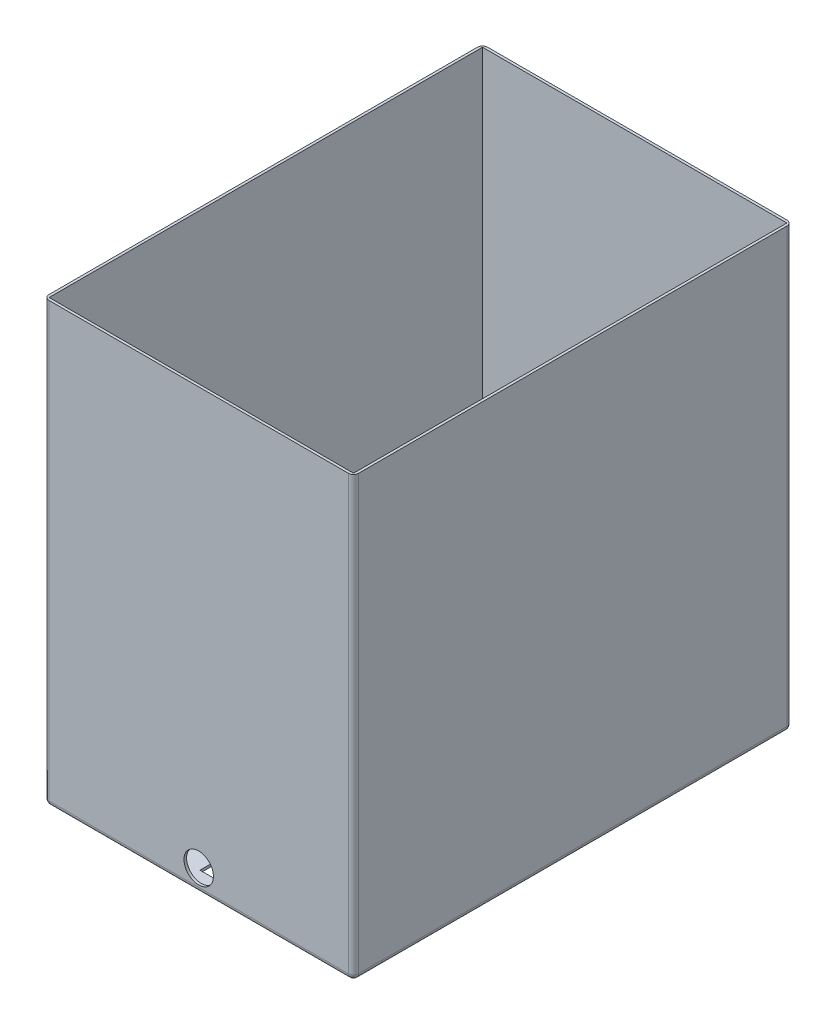
ISO-10303-21;
HEADER;
FILE_DESCRIPTION(('STEP AP214'),'2;1');
FILE_NAME('part.step','',(''),(''),'','','');
FILE_SCHEMA(('AUTOMOTIVE_DESIGN { 1 0 10303 214 1 1 1 1 }'));
ENDSEC;
DATA;
#1=APPLICATION_CONTEXT('core data for automotive mechanical design processes');
#2=APPLICATION_PROTOCOL_DEFINITION('international standard','automotive_design',2000,#1);
#3=PRODUCT_CONTEXT('',#1,'mechanical');
#4=PRODUCT('Part','Part','',(#3));
#5=PRODUCT_RELATED_PRODUCT_CATEGORY('part','',(#4));
#6=PRODUCT_DEFINITION_FORMATION('','',#4);
#7=PRODUCT_DEFINITION_CONTEXT('part definition',#1,'design');
#8=PRODUCT_DEFINITION('design','',#6,#7);
#9=PRODUCT_DEFINITION_SHAPE('','',#8);
#10=(LENGTH_UNIT() NAMED_UNIT(*) SI_UNIT(.MILLI.,.METRE.));
#11=(NAMED_UNIT(*) PLANE_ANGLE_UNIT() SI_UNIT($,.RADIAN.));
#12=(NAMED_UNIT(*) SI_UNIT($,.STERADIAN.) SOLID_ANGLE_UNIT());
#13=UNCERTAINTY_MEASURE_WITH_UNIT(LENGTH_MEASURE(1.E-05),#10,'distance_accuracy_value','');
#14=(GEOMETRIC_REPRESENTATION_CONTEXT(3) GLOBAL_UNCERTAINTY_ASSIGNED_CONTEXT((#13)) GLOBAL_UNIT_ASSIGNED_CONTEXT((#10,
#11,#12)) REPRESENTATION_CONTEXT('',''));
#15=CARTESIAN_POINT('',(0.,0.,0.));
#16=DIRECTION('',(0.,0.,1.));
#17=DIRECTION('',(1.,0.,0.));
#18=AXIS2_PLACEMENT_3D('',#15,#16,#17);
#19=CARTESIAN_POINT('',(0.,0.,431.8));
#20=DIRECTION('',(1.,0.,0.));
#21=DIRECTION('',(0.,0.,-1.));
#22=AXIS2_PLACEMENT_3D('',#19,#20,#21);
#23=PLANE('',#22);
#24=DIRECTION('',(0.,0.,-1.));
#25=VECTOR('',#24,1.);
#26=CARTESIAN_POINT('',(0.,431.8,431.8));
#27=LINE('',#26,#25);
#28=CARTESIAN_POINT('',(0.,431.8,426.72));
#29=VERTEX_POINT('',#28);
#30=CARTESIAN_POINT('',(0.,431.8,5.07999999999997));
#31=VERTEX_POINT('',#30);
#32=EDGE_CURVE('E234',#29,#31,#27,.T.);
#33=ORIENTED_EDGE('',*,*,#32,.T.);
#34=DIRECTION('',(0.,-1.,0.));
#35=VECTOR('',#34,1.);
#36=CARTESIAN_POINT('',(0.,0.,5.07999999999997));
#37=LINE('',#36,#35);
#38=CARTESIAN_POINT('',(0.,5.08,5.07999999999997));
#39=VERTEX_POINT('',#38);
#40=EDGE_CURVE('E256',#31,#39,#37,.T.);
#41=ORIENTED_EDGE('',*,*,#40,.T.);
#42=DIRECTION('',(0.,0.,-1.));
#43=VECTOR('',#42,1.);
#44=CARTESIAN_POINT('',(0.,5.08,431.8));
#45=LINE('',#44,#43);
#46=CARTESIAN_POINT('',(0.,5.08,426.72));
#47=VERTEX_POINT('',#46);
#48=EDGE_CURVE('E253',#39,#47,#45,.F.);
#49=ORIENTED_EDGE('',*,*,#48,.T.);
#50=DIRECTION('',(0.,-1.,0.));
#51=VECTOR('',#50,1.);
#52=CARTESIAN_POINT('',(0.,0.,426.72));
#53=LINE('',#52,#51);
#54=EDGE_CURVE('E251',#47,#29,#53,.F.);
#55=ORIENTED_EDGE('',*,*,#54,.T.);
#56=EDGE_LOOP('',(#33,#41,#49,#55));
#57=FACE_BOUND('',#56,.T.);
#58=ADVANCED_FACE('F36',(#57),#23,.F.);
#59=CARTESIAN_POINT('',(0.,0.,431.8));
#60=DIRECTION('',(0.,1.,0.));
#61=DIRECTION('',(0.,0.,1.));
#62=AXIS2_PLACEMENT_3D('',#59,#60,#61);
#63=PLANE('',#62);
#64=DIRECTION('',(-1.,0.,0.));
#65=VECTOR('',#64,1.);
#66=CARTESIAN_POINT('',(135.89,0.,327.914));
#67=LINE('',#66,#65);
#68=CARTESIAN_POINT('',(168.91,0.,327.914));
#69=VERTEX_POINT('',#68);
#70=CARTESIAN_POINT('',(135.89,0.,327.914));
#71=VERTEX_POINT('',#70);
#72=EDGE_CURVE('E170',#69,#71,#67,.T.);
#73=ORIENTED_EDGE('',*,*,#72,.T.);
#74=DIRECTION('',(0.,0.,1.));
#75=VECTOR('',#74,1.);
#76=CARTESIAN_POINT('',(135.89,0.,414.02));
#77=LINE('',#76,#75);
#78=CARTESIAN_POINT('',(135.89,0.,414.02));
#79=VERTEX_POINT('',#78);
#80=EDGE_CURVE('E164',#71,#79,#77,.T.);
#81=ORIENTED_EDGE('',*,*,#80,.T.);
#82=DIRECTION('',(1.,0.,0.));
#83=VECTOR('',#82,1.);
#84=CARTESIAN_POINT('',(135.89,0.,414.02));
#85=LINE('',#84,#83);
#86=CARTESIAN_POINT('',(168.91,0.,414.02));
#87=VERTEX_POINT('',#86);
#88=EDGE_CURVE('E173',#79,#87,#85,.T.);
#89=ORIENTED_EDGE('',*,*,#88,.T.);
#90=DIRECTION('',(0.,0.,-1.));
#91=VECTOR('',#90,1.);
#92=CARTESIAN_POINT('',(168.91,0.,414.02));
#93=LINE('',#92,#91);
#94=EDGE_CURVE('E53',#87,#69,#93,.T.);
#95=ORIENTED_EDGE('',*,*,#94,.T.);
#96=EDGE_LOOP('',(#73,#81,#89,#95));
#97=FACE_BOUND('',#96,.T.);
#98=DIRECTION('',(1.,0.,0.));
#99=VECTOR('',#98,1.);
#100=CARTESIAN_POINT('',(0.,0.,426.72));
#101=LINE('',#100,#99);
#102=CARTESIAN_POINT('',(299.72,0.,426.72));
#103=VERTEX_POINT('',#102);
#104=CARTESIAN_POINT('',(5.08,0.,426.72));
#105=VERTEX_POINT('',#104);
#106=EDGE_CURVE('E246',#103,#105,#101,.F.);
#107=ORIENTED_EDGE('',*,*,#106,.T.);
#108=DIRECTION('',(0.,0.,-1.));
#109=VECTOR('',#108,1.);
#110=CARTESIAN_POINT('',(5.08,0.,431.8));
#111=LINE('',#110,#109);
#112=CARTESIAN_POINT('',(5.08,0.,5.07999999999997));
#113=VERTEX_POINT('',#112);
#114=EDGE_CURVE('E248',#105,#113,#111,.T.);
#115=ORIENTED_EDGE('',*,*,#114,.T.);
#116=DIRECTION('',(1.,0.,0.));
#117=VECTOR('',#116,1.);
#118=CARTESIAN_POINT('',(304.8,0.,5.07999999999997));
#119=LINE('',#118,#117);
#120=CARTESIAN_POINT('',(299.72,0.,5.07999999999997));
#121=VERTEX_POINT('',#120);
#122=EDGE_CURVE('E242',#113,#121,#119,.T.);
#123=ORIENTED_EDGE('',*,*,#122,.T.);
#124=DIRECTION('',(0.,0.,-1.));
#125=VECTOR('',#124,1.);
#126=CARTESIAN_POINT('',(299.72,0.,431.8));
#127=LINE('',#126,#125);
#128=EDGE_CURVE('E244',#121,#103,#127,.F.);
#129=ORIENTED_EDGE('',*,*,#128,.T.);
#130=EDGE_LOOP('',(#107,#115,#123,#129));
#131=FACE_BOUND('',#130,.T.);
#132=ADVANCED_FACE('F177',(#97,#131),#63,.F.);
#133=CARTESIAN_POINT('',(304.8,0.,431.8));
#134=DIRECTION('',(-1.,0.,0.));
#135=DIRECTION('',(0.,0.,1.));
#136=AXIS2_PLACEMENT_3D('',#133,#134,#135);
#137=PLANE('',#136);
#138=DIRECTION('',(0.,0.,-1.));
#139=VECTOR('',#138,1.);
#140=CARTESIAN_POINT('',(304.8,5.08,431.8));
#141=LINE('',#140,#139);
#142=CARTESIAN_POINT('',(304.8,5.08,426.72));
#143=VERTEX_POINT('',#142);
#144=CARTESIAN_POINT('',(304.8,5.08,5.07999999999997));
#145=VERTEX_POINT('',#144);
#146=EDGE_CURVE('E266',#143,#145,#141,.T.);
#147=ORIENTED_EDGE('',*,*,#146,.T.);
#148=DIRECTION('',(0.,1.,0.));
#149=VECTOR('',#148,1.);
#150=CARTESIAN_POINT('',(304.8,431.8,5.07999999999997));
#151=LINE('',#150,#149);
#152=CARTESIAN_POINT('',(304.8,431.8,5.07999999999997));
#153=VERTEX_POINT('',#152);
#154=EDGE_CURVE('E268',#145,#153,#151,.T.);
#155=ORIENTED_EDGE('',*,*,#154,.T.);
#156=DIRECTION('',(0.,0.,-1.));
#157=VECTOR('',#156,1.);
#158=CARTESIAN_POINT('',(304.8,431.8,431.8));
#159=LINE('',#158,#157);
#160=CARTESIAN_POINT('',(304.8,431.8,426.72));
#161=VERTEX_POINT('',#160);
#162=EDGE_CURVE('E239',#161,#153,#159,.T.);
#163=ORIENTED_EDGE('',*,*,#162,.F.);
#164=DIRECTION('',(0.,1.,0.));
#165=VECTOR('',#164,1.);
#166=CARTESIAN_POINT('',(304.8,0.,426.72));
#167=LINE('',#166,#165);
#168=EDGE_CURVE('E264',#161,#143,#167,.F.);
#169=ORIENTED_EDGE('',*,*,#168,.T.);
#170=EDGE_LOOP('',(#147,#155,#163,#169));
#171=FACE_BOUND('',#170,.T.);
#172=ADVANCED_FACE('F335',(#171),#137,.F.);
#173=CARTESIAN_POINT('',(0.,431.8,431.8));
#174=DIRECTION('',(0.,-1.,0.));
#175=DIRECTION('',(0.,0.,-1.));
#176=AXIS2_PLACEMENT_3D('',#173,#174,#175);
#177=PLANE('',#176);
#178=DIRECTION('',(-1.,0.,0.));
#179=VECTOR('',#178,1.);
#180=CARTESIAN_POINT('',(302.26,431.8,2.54));
#181=LINE('',#180,#179);
#182=CARTESIAN_POINT('',(302.26,431.8,2.53999999999999));
#183=VERTEX_POINT('',#182);
#184=CARTESIAN_POINT('',(2.54,431.8,2.54));
#185=VERTEX_POINT('',#184);
#186=EDGE_CURVE('E211',#183,#185,#181,.T.);
#187=ORIENTED_EDGE('',*,*,#186,.F.);
#188=DIRECTION('',(0.,0.,-1.));
#189=VECTOR('',#188,1.);
#190=CARTESIAN_POINT('',(302.26,431.8,429.26));
#191=LINE('',#190,#189);
#192=CARTESIAN_POINT('',(302.26,431.8,429.26));
#193=VERTEX_POINT('',#192);
#194=EDGE_CURVE('E209',#193,#183,#191,.T.);
#195=ORIENTED_EDGE('',*,*,#194,.F.);
#196=DIRECTION('',(1.,0.,0.));
#197=VECTOR('',#196,1.);
#198=CARTESIAN_POINT('',(2.54,431.8,429.26));
#199=LINE('',#198,#197);
#200=CARTESIAN_POINT('',(2.54,431.8,429.26));
#201=VERTEX_POINT('',#200);
#202=EDGE_CURVE('E218',#201,#193,#199,.T.);
#203=ORIENTED_EDGE('',*,*,#202,.F.);
#204=DIRECTION('',(0.,0.,1.));
#205=VECTOR('',#204,1.);
#206=CARTESIAN_POINT('',(2.54,431.8,2.54));
#207=LINE('',#206,#205);
#208=EDGE_CURVE('E215',#185,#201,#207,.T.);
#209=ORIENTED_EDGE('',*,*,#208,.F.);
#210=EDGE_LOOP('',(#187,#195,#203,#209));
#211=FACE_BOUND('',#210,.T.);
#212=DIRECTION('',(-1.,0.,0.));
#213=VECTOR('',#212,1.);
#214=CARTESIAN_POINT('',(0.,431.8,0.));
#215=LINE('',#214,#213);
#216=CARTESIAN_POINT('',(299.72,431.8,0.));
#217=VERTEX_POINT('',#216);
#218=CARTESIAN_POINT('',(5.08,431.8,0.));
#219=VERTEX_POINT('',#218);
#220=EDGE_CURVE('E230',#217,#219,#215,.T.);
#221=ORIENTED_EDGE('',*,*,#220,.T.);
#222=CARTESIAN_POINT('',(5.08,431.8,5.07999999999997));
#223=DIRECTION('',(0.,-1.,0.));
#224=DIRECTION('',(0.,0.,-1.));
#225=AXIS2_PLACEMENT_3D('',#222,#223,#224);
#226=CIRCLE('',#225,5.08);
#227=EDGE_CURVE('E12',#219,#31,#226,.F.);
#228=ORIENTED_EDGE('',*,*,#227,.T.);
#229=ORIENTED_EDGE('',*,*,#32,.F.);
#230=CARTESIAN_POINT('',(5.08,431.8,426.72));
#231=DIRECTION('',(0.,-1.,0.));
#232=DIRECTION('',(0.,0.,-1.));
#233=AXIS2_PLACEMENT_3D('',#230,#231,#232);
#234=CIRCLE('',#233,5.08);
#235=CARTESIAN_POINT('',(5.08,431.8,431.8));
#236=VERTEX_POINT('',#235);
#237=EDGE_CURVE('E276',#29,#236,#234,.F.);
#238=ORIENTED_EDGE('',*,*,#237,.T.);
#239=DIRECTION('',(-1.,0.,0.));
#240=VECTOR('',#239,1.);
#241=CARTESIAN_POINT('',(0.,431.8,431.8));
#242=LINE('',#241,#240);
#243=CARTESIAN_POINT('',(299.72,431.8,431.8));
#244=VERTEX_POINT('',#243);
#245=EDGE_CURVE('E231',#244,#236,#242,.T.);
#246=ORIENTED_EDGE('',*,*,#245,.F.);
#247=CARTESIAN_POINT('',(299.72,431.8,426.72));
#248=DIRECTION('',(0.,-1.,0.));
#249=DIRECTION('',(0.,0.,-1.));
#250=AXIS2_PLACEMENT_3D('',#247,#248,#249);
#251=CIRCLE('',#250,5.08);
#252=EDGE_CURVE('E278',#244,#161,#251,.F.);
#253=ORIENTED_EDGE('',*,*,#252,.T.);
#254=ORIENTED_EDGE('',*,*,#162,.T.);
#255=CARTESIAN_POINT('',(299.72,431.8,5.07999999999997));
#256=DIRECTION('',(0.,-1.,0.));
#257=DIRECTION('',(0.,0.,-1.));
#258=AXIS2_PLACEMENT_3D('',#255,#256,#257);
#259=CIRCLE('',#258,5.08);
#260=EDGE_CURVE('E45',#153,#217,#259,.F.);
#261=ORIENTED_EDGE('',*,*,#260,.T.);
#262=EDGE_LOOP('',(#221,#228,#229,#238,#246,#253,#254,#261));
#263=FACE_BOUND('',#262,.T.);
#264=ADVANCED_FACE('F345',(#211,#263),#177,.F.);
#265=CARTESIAN_POINT('',(0.,0.,431.8));
#266=DIRECTION('',(0.,0.,-1.));
#267=DIRECTION('',(-1.,0.,0.));
#268=AXIS2_PLACEMENT_3D('',#265,#266,#267);
#269=PLANE('',#268);
#270=CARTESIAN_POINT('',(152.4,21.59,431.8));
#271=DIRECTION('',(0.,0.,1.));
#272=DIRECTION('',(1.,0.,0.));
#273=AXIS2_PLACEMENT_3D('',#270,#271,#272);
#274=CIRCLE('',#273,14.478);
#275=CARTESIAN_POINT('',(166.878,21.59,431.8));
#276=VERTEX_POINT('',#275);
#277=EDGE_CURVE('E186',#276,#276,#274,.T.);
#278=ORIENTED_EDGE('',*,*,#277,.F.);
#279=EDGE_LOOP('',(#278));
#280=FACE_BOUND('',#279,.T.);
#281=DIRECTION('',(1.,0.,0.));
#282=VECTOR('',#281,1.);
#283=CARTESIAN_POINT('',(0.,5.08,431.8));
#284=LINE('',#283,#282);
#285=CARTESIAN_POINT('',(5.08,5.08,431.8));
#286=VERTEX_POINT('',#285);
#287=CARTESIAN_POINT('',(299.72,5.08,431.8));
#288=VERTEX_POINT('',#287);
#289=EDGE_CURVE('E260',#286,#288,#284,.T.);
#290=ORIENTED_EDGE('',*,*,#289,.T.);
#291=DIRECTION('',(0.,1.,0.));
#292=VECTOR('',#291,1.);
#293=CARTESIAN_POINT('',(299.72,0.,431.8));
#294=LINE('',#293,#292);
#295=EDGE_CURVE('E262',#288,#244,#294,.T.);
#296=ORIENTED_EDGE('',*,*,#295,.T.);
#297=ORIENTED_EDGE('',*,*,#245,.T.);
#298=DIRECTION('',(0.,-1.,0.));
#299=VECTOR('',#298,1.);
#300=CARTESIAN_POINT('',(5.08,0.,431.8));
#301=LINE('',#300,#299);
#302=EDGE_CURVE('E258',#236,#286,#301,.T.);
#303=ORIENTED_EDGE('',*,*,#302,.T.);
#304=EDGE_LOOP('',(#290,#296,#297,#303));
#305=FACE_BOUND('',#304,.T.);
#306=ADVANCED_FACE('F373',(#280,#305),#269,.F.);
#307=CARTESIAN_POINT('',(0.,0.,0.));
#308=DIRECTION('',(0.,0.,-1.));
#309=DIRECTION('',(-1.,0.,0.));
#310=AXIS2_PLACEMENT_3D('',#307,#308,#309);
#311=PLANE('',#310);
#312=DIRECTION('',(1.,0.,0.));
#313=VECTOR('',#312,1.);
#314=CARTESIAN_POINT('',(0.,5.08,0.));
#315=LINE('',#314,#313);
#316=CARTESIAN_POINT('',(299.72,5.08,0.));
#317=VERTEX_POINT('',#316);
#318=CARTESIAN_POINT('',(5.08,5.08,0.));
#319=VERTEX_POINT('',#318);
#320=EDGE_CURVE('E272',#317,#319,#315,.F.);
#321=ORIENTED_EDGE('',*,*,#320,.T.);
#322=DIRECTION('',(0.,-1.,0.));
#323=VECTOR('',#322,1.);
#324=CARTESIAN_POINT('',(5.08,431.8,0.));
#325=LINE('',#324,#323);
#326=EDGE_CURVE('E274',#319,#219,#325,.F.);
#327=ORIENTED_EDGE('',*,*,#326,.T.);
#328=ORIENTED_EDGE('',*,*,#220,.F.);
#329=DIRECTION('',(0.,1.,0.));
#330=VECTOR('',#329,1.);
#331=CARTESIAN_POINT('',(299.72,0.,0.));
#332=LINE('',#331,#330);
#333=EDGE_CURVE('E270',#217,#317,#332,.F.);
#334=ORIENTED_EDGE('',*,*,#333,.T.);
#335=EDGE_LOOP('',(#321,#327,#328,#334));
#336=FACE_BOUND('',#335,.T.);
#337=ADVANCED_FACE('F348',(#336),#311,.T.);
#338=CARTESIAN_POINT('',(302.26,-521.461443253478,429.26));
#339=DIRECTION('',(1.,0.,0.));
#340=DIRECTION('',(0.,0.,-1.));
#341=AXIS2_PLACEMENT_3D('',#338,#339,#340);
#342=PLANE('',#341);
#343=DIRECTION('',(0.,0.,1.));
#344=VECTOR('',#343,1.);
#345=CARTESIAN_POINT('',(302.26,2.53999999999999,429.26));
#346=LINE('',#345,#344);
#347=CARTESIAN_POINT('',(302.26,2.53999999999999,2.54));
#348=VERTEX_POINT('',#347);
#349=CARTESIAN_POINT('',(302.26,2.53999999999999,429.26));
#350=VERTEX_POINT('',#349);
#351=EDGE_CURVE('E206',#348,#350,#346,.T.);
#352=ORIENTED_EDGE('',*,*,#351,.T.);
#353=DIRECTION('',(0.,1.,0.));
#354=VECTOR('',#353,1.);
#355=CARTESIAN_POINT('',(302.26,-521.461443253478,429.26));
#356=LINE('',#355,#354);
#357=EDGE_CURVE('E204',#350,#193,#356,.T.);
#358=ORIENTED_EDGE('',*,*,#357,.T.);
#359=ORIENTED_EDGE('',*,*,#194,.T.);
#360=DIRECTION('',(0.,1.,0.));
#361=VECTOR('',#360,1.);
#362=CARTESIAN_POINT('',(302.26,-521.461443253478,2.54));
#363=LINE('',#362,#361);
#364=EDGE_CURVE('E221',#348,#183,#363,.T.);
#365=ORIENTED_EDGE('',*,*,#364,.F.);
#366=EDGE_LOOP('',(#352,#358,#359,#365));
#367=FACE_BOUND('',#366,.T.);
#368=ADVANCED_FACE('F504',(#367),#342,.F.);
#369=CARTESIAN_POINT('',(2.54,-521.461443253478,429.26));
#370=DIRECTION('',(0.,0.,1.));
#371=DIRECTION('',(1.,0.,0.));
#372=AXIS2_PLACEMENT_3D('',#369,#370,#371);
#373=PLANE('',#372);
#374=CARTESIAN_POINT('',(152.4,21.59,429.26));
#375=DIRECTION('',(0.,0.,1.));
#376=DIRECTION('',(1.,0.,0.));
#377=AXIS2_PLACEMENT_3D('',#374,#375,#376);
#378=CIRCLE('',#377,14.478);
#379=CARTESIAN_POINT('',(166.878,21.59,429.26));
#380=VERTEX_POINT('',#379);
#381=EDGE_CURVE('E40',#380,#380,#378,.T.);
#382=ORIENTED_EDGE('',*,*,#381,.T.);
#383=EDGE_LOOP('',(#382));
#384=FACE_BOUND('',#383,.T.);
#385=DIRECTION('',(-1.,0.,0.));
#386=VECTOR('',#385,1.);
#387=CARTESIAN_POINT('',(2.54,2.53999999999999,429.26));
#388=LINE('',#387,#386);
#389=CARTESIAN_POINT('',(2.54,2.53999999999999,429.26));
#390=VERTEX_POINT('',#389);
#391=EDGE_CURVE('E203',#350,#390,#388,.T.);
#392=ORIENTED_EDGE('',*,*,#391,.T.);
#393=DIRECTION('',(0.,1.,0.));
#394=VECTOR('',#393,1.);
#395=CARTESIAN_POINT('',(2.54,-521.461443253478,429.26));
#396=LINE('',#395,#394);
#397=EDGE_CURVE('E223',#390,#201,#396,.T.);
#398=ORIENTED_EDGE('',*,*,#397,.T.);
#399=ORIENTED_EDGE('',*,*,#202,.T.);
#400=ORIENTED_EDGE('',*,*,#357,.F.);
#401=EDGE_LOOP('',(#392,#398,#399,#400));
#402=FACE_BOUND('',#401,.T.);
#403=ADVANCED_FACE('F498',(#384,#402),#373,.F.);
#404=CARTESIAN_POINT('',(2.54,-521.461443253478,2.54));
#405=DIRECTION('',(-1.,0.,0.));
#406=DIRECTION('',(0.,0.,1.));
#407=AXIS2_PLACEMENT_3D('',#404,#405,#406);
#408=PLANE('',#407);
#409=DIRECTION('',(0.,0.,-1.));
#410=VECTOR('',#409,1.);
#411=CARTESIAN_POINT('',(2.54,2.53999999999999,2.54));
#412=LINE('',#411,#410);
#413=CARTESIAN_POINT('',(2.54,2.53999999999999,2.54));
#414=VERTEX_POINT('',#413);
#415=EDGE_CURVE('E201',#390,#414,#412,.T.);
#416=ORIENTED_EDGE('',*,*,#415,.T.);
#417=DIRECTION('',(0.,1.,0.));
#418=VECTOR('',#417,1.);
#419=CARTESIAN_POINT('',(2.54,-521.461443253478,2.54));
#420=LINE('',#419,#418);
#421=EDGE_CURVE('E225',#414,#185,#420,.T.);
#422=ORIENTED_EDGE('',*,*,#421,.T.);
#423=ORIENTED_EDGE('',*,*,#208,.T.);
#424=ORIENTED_EDGE('',*,*,#397,.F.);
#425=EDGE_LOOP('',(#416,#422,#423,#424));
#426=FACE_BOUND('',#425,.T.);
#427=ADVANCED_FACE('F503',(#426),#408,.F.);
#428=CARTESIAN_POINT('',(302.26,-521.461443253478,2.54));
#429=DIRECTION('',(0.,0.,-1.));
#430=DIRECTION('',(-1.,0.,0.));
#431=AXIS2_PLACEMENT_3D('',#428,#429,#430);
#432=PLANE('',#431);
#433=DIRECTION('',(1.,0.,0.));
#434=VECTOR('',#433,1.);
#435=CARTESIAN_POINT('',(302.26,2.53999999999999,2.54));
#436=LINE('',#435,#434);
#437=EDGE_CURVE('E208',#414,#348,#436,.T.);
#438=ORIENTED_EDGE('',*,*,#437,.T.);
#439=ORIENTED_EDGE('',*,*,#364,.T.);
#440=ORIENTED_EDGE('',*,*,#186,.T.);
#441=ORIENTED_EDGE('',*,*,#421,.F.);
#442=EDGE_LOOP('',(#438,#439,#440,#441));
#443=FACE_BOUND('',#442,.T.);
#444=ADVANCED_FACE('F381',(#443),#432,.F.);
#445=CARTESIAN_POINT('',(0.,2.54,431.8));
#446=DIRECTION('',(0.,1.,0.));
#447=DIRECTION('',(0.,0.,1.));
#448=AXIS2_PLACEMENT_3D('',#445,#446,#447);
#449=PLANE('',#448);
#450=DIRECTION('',(0.,0.,1.));
#451=VECTOR('',#450,1.);
#452=CARTESIAN_POINT('',(135.89,2.54,414.02));
#453=LINE('',#452,#451);
#454=CARTESIAN_POINT('',(135.89,2.54,327.914));
#455=VERTEX_POINT('',#454);
#456=CARTESIAN_POINT('',(135.89,2.54,414.02));
#457=VERTEX_POINT('',#456);
#458=EDGE_CURVE('E61',#455,#457,#453,.T.);
#459=ORIENTED_EDGE('',*,*,#458,.F.);
#460=DIRECTION('',(-1.,0.,0.));
#461=VECTOR('',#460,1.);
#462=CARTESIAN_POINT('',(135.89,2.54,327.914));
#463=LINE('',#462,#461);
#464=CARTESIAN_POINT('',(168.91,2.54,327.914));
#465=VERTEX_POINT('',#464);
#466=EDGE_CURVE('E180',#465,#455,#463,.T.);
#467=ORIENTED_EDGE('',*,*,#466,.F.);
#468=DIRECTION('',(0.,0.,-1.));
#469=VECTOR('',#468,1.);
#470=CARTESIAN_POINT('',(168.91,2.54,414.02));
#471=LINE('',#470,#469);
#472=CARTESIAN_POINT('',(168.91,2.54,414.02));
#473=VERTEX_POINT('',#472);
#474=EDGE_CURVE('E183',#473,#465,#471,.T.);
#475=ORIENTED_EDGE('',*,*,#474,.F.);
#476=DIRECTION('',(1.,0.,0.));
#477=VECTOR('',#476,1.);
#478=CARTESIAN_POINT('',(135.89,2.54,414.02));
#479=LINE('',#478,#477);
#480=EDGE_CURVE('E191',#457,#473,#479,.T.);
#481=ORIENTED_EDGE('',*,*,#480,.F.);
#482=EDGE_LOOP('',(#459,#467,#475,#481));
#483=FACE_BOUND('',#482,.T.);
#484=ORIENTED_EDGE('',*,*,#351,.F.);
#485=ORIENTED_EDGE('',*,*,#437,.F.);
#486=ORIENTED_EDGE('',*,*,#415,.F.);
#487=ORIENTED_EDGE('',*,*,#391,.F.);
#488=EDGE_LOOP('',(#484,#485,#486,#487));
#489=FACE_BOUND('',#488,.T.);
#490=ADVANCED_FACE('F376',(#483,#489),#449,.T.);
#491=CARTESIAN_POINT('',(299.72,0.,426.72));
#492=DIRECTION('',(0.,1.,0.));
#493=DIRECTION('',(0.,0.,1.));
#494=AXIS2_PLACEMENT_3D('',#491,#492,#493);
#495=CYLINDRICAL_SURFACE('',#494,5.08);
#496=ORIENTED_EDGE('',*,*,#252,.F.);
#497=ORIENTED_EDGE('',*,*,#295,.F.);
#498=CARTESIAN_POINT('',(299.72,5.08,426.72));
#499=DIRECTION('',(0.,-1.,0.));
#500=DIRECTION('',(0.,0.,-1.));
#501=AXIS2_PLACEMENT_3D('',#498,#499,#500);
#502=CIRCLE('',#501,5.08);
#503=EDGE_CURVE('E212',#143,#288,#502,.T.);
#504=ORIENTED_EDGE('',*,*,#503,.F.);
#505=ORIENTED_EDGE('',*,*,#168,.F.);
#506=EDGE_LOOP('',(#496,#497,#504,#505));
#507=FACE_BOUND('',#506,.T.);
#508=ADVANCED_FACE('F38',(#507),#495,.T.);
#509=CARTESIAN_POINT('',(299.72,5.08,431.8));
#510=DIRECTION('',(0.,0.,-1.));
#511=DIRECTION('',(-1.,0.,0.));
#512=AXIS2_PLACEMENT_3D('',#509,#510,#511);
#513=CYLINDRICAL_SURFACE('',#512,5.08);
#514=CARTESIAN_POINT('',(299.72,5.08,5.07999999999997));
#515=DIRECTION('',(0.,0.,-1.));
#516=DIRECTION('',(-1.,0.,0.));
#517=AXIS2_PLACEMENT_3D('',#514,#515,#516);
#518=CIRCLE('',#517,5.08);
#519=EDGE_CURVE('E305',#145,#121,#518,.T.);
#520=ORIENTED_EDGE('',*,*,#519,.F.);
#521=ORIENTED_EDGE('',*,*,#146,.F.);
#522=CARTESIAN_POINT('',(299.72,5.08,426.72));
#523=DIRECTION('',(0.,0.,1.));
#524=DIRECTION('',(1.,0.,0.));
#525=AXIS2_PLACEMENT_3D('',#522,#523,#524);
#526=CIRCLE('',#525,5.08);
#527=EDGE_CURVE('E308',#103,#143,#526,.T.);
#528=ORIENTED_EDGE('',*,*,#527,.F.);
#529=ORIENTED_EDGE('',*,*,#128,.F.);
#530=EDGE_LOOP('',(#520,#521,#528,#529));
#531=FACE_BOUND('',#530,.T.);
#532=ADVANCED_FACE('F332',(#531),#513,.T.);
#533=CARTESIAN_POINT('',(299.72,0.,5.07999999999997));
#534=DIRECTION('',(0.,-1.,0.));
#535=DIRECTION('',(0.,0.,-1.));
#536=AXIS2_PLACEMENT_3D('',#533,#534,#535);
#537=CYLINDRICAL_SURFACE('',#536,5.08);
#538=ORIENTED_EDGE('',*,*,#260,.F.);
#539=ORIENTED_EDGE('',*,*,#154,.F.);
#540=CARTESIAN_POINT('',(299.72,5.08,5.08));
#541=DIRECTION('',(0.,-1.,0.));
#542=DIRECTION('',(0.,0.,-1.));
#543=AXIS2_PLACEMENT_3D('',#540,#541,#542);
#544=CIRCLE('',#543,5.08);
#545=EDGE_CURVE('E302',#317,#145,#544,.T.);
#546=ORIENTED_EDGE('',*,*,#545,.F.);
#547=ORIENTED_EDGE('',*,*,#333,.F.);
#548=EDGE_LOOP('',(#538,#539,#546,#547));
#549=FACE_BOUND('',#548,.T.);
#550=ADVANCED_FACE('F340',(#549),#537,.T.);
#551=CARTESIAN_POINT('',(299.72,5.08,426.72));
#552=DIRECTION('',(1.,0.,0.));
#553=DIRECTION('',(0.,0.,-1.));
#554=AXIS2_PLACEMENT_3D('',#551,#552,#553);
#555=SPHERICAL_SURFACE('',#554,5.08);
#556=ORIENTED_EDGE('',*,*,#527,.T.);
#557=ORIENTED_EDGE('',*,*,#503,.T.);
#558=CARTESIAN_POINT('',(299.72,5.08,426.72));
#559=DIRECTION('',(1.,0.,0.));
#560=DIRECTION('',(0.,0.,-1.));
#561=AXIS2_PLACEMENT_3D('',#558,#559,#560);
#562=CIRCLE('',#561,5.08);
#563=EDGE_CURVE('E299',#103,#288,#562,.F.);
#564=ORIENTED_EDGE('',*,*,#563,.F.);
#565=EDGE_LOOP('',(#556,#557,#564));
#566=FACE_BOUND('',#565,.T.);
#567=ADVANCED_FACE('F314',(#566),#555,.T.);
#568=CARTESIAN_POINT('',(299.72,5.08,5.08));
#569=DIRECTION('',(1.,0.,0.));
#570=DIRECTION('',(0.,0.,-1.));
#571=AXIS2_PLACEMENT_3D('',#568,#569,#570);
#572=SPHERICAL_SURFACE('',#571,5.08);
#573=ORIENTED_EDGE('',*,*,#545,.T.);
#574=ORIENTED_EDGE('',*,*,#519,.T.);
#575=CARTESIAN_POINT('',(299.72,5.08,5.07999999999997));
#576=DIRECTION('',(1.,0.,0.));
#577=DIRECTION('',(0.,0.,-1.));
#578=AXIS2_PLACEMENT_3D('',#575,#576,#577);
#579=CIRCLE('',#578,5.08);
#580=EDGE_CURVE('E296',#317,#121,#579,.F.);
#581=ORIENTED_EDGE('',*,*,#580,.F.);
#582=EDGE_LOOP('',(#573,#574,#581));
#583=FACE_BOUND('',#582,.T.);
#584=ADVANCED_FACE('F408',(#583),#572,.T.);
#585=CARTESIAN_POINT('',(5.08,0.,426.72));
#586=DIRECTION('',(0.,-1.,0.));
#587=DIRECTION('',(0.,0.,-1.));
#588=AXIS2_PLACEMENT_3D('',#585,#586,#587);
#589=CYLINDRICAL_SURFACE('',#588,5.08);
#590=ORIENTED_EDGE('',*,*,#237,.F.);
#591=ORIENTED_EDGE('',*,*,#54,.F.);
#592=CARTESIAN_POINT('',(5.08,5.08,426.72));
#593=DIRECTION('',(0.,-1.,0.));
#594=DIRECTION('',(0.,0.,-1.));
#595=AXIS2_PLACEMENT_3D('',#592,#593,#594);
#596=CIRCLE('',#595,5.08);
#597=EDGE_CURVE('E293',#286,#47,#596,.T.);
#598=ORIENTED_EDGE('',*,*,#597,.F.);
#599=ORIENTED_EDGE('',*,*,#302,.F.);
#600=EDGE_LOOP('',(#590,#591,#598,#599));
#601=FACE_BOUND('',#600,.T.);
#602=ADVANCED_FACE('F371',(#601),#589,.T.);
#603=CARTESIAN_POINT('',(0.,5.08,426.72));
#604=DIRECTION('',(1.,0.,0.));
#605=DIRECTION('',(0.,0.,-1.));
#606=AXIS2_PLACEMENT_3D('',#603,#604,#605);
#607=CYLINDRICAL_SURFACE('',#606,5.08);
#608=ORIENTED_EDGE('',*,*,#563,.T.);
#609=ORIENTED_EDGE('',*,*,#289,.F.);
#610=CARTESIAN_POINT('',(5.08,5.08,426.72));
#611=DIRECTION('',(-1.,0.,0.));
#612=DIRECTION('',(0.,0.,1.));
#613=AXIS2_PLACEMENT_3D('',#610,#611,#612);
#614=CIRCLE('',#613,5.08);
#615=EDGE_CURVE('E290',#105,#286,#614,.T.);
#616=ORIENTED_EDGE('',*,*,#615,.F.);
#617=ORIENTED_EDGE('',*,*,#106,.F.);
#618=EDGE_LOOP('',(#608,#609,#616,#617));
#619=FACE_BOUND('',#618,.T.);
#620=ADVANCED_FACE('F322',(#619),#607,.T.);
#621=CARTESIAN_POINT('',(0.,5.08,5.07999999999997));
#622=DIRECTION('',(-1.,0.,0.));
#623=DIRECTION('',(0.,0.,1.));
#624=AXIS2_PLACEMENT_3D('',#621,#622,#623);
#625=CYLINDRICAL_SURFACE('',#624,5.08);
#626=ORIENTED_EDGE('',*,*,#580,.T.);
#627=ORIENTED_EDGE('',*,*,#122,.F.);
#628=CARTESIAN_POINT('',(5.08,5.08,5.08));
#629=DIRECTION('',(-1.,0.,0.));
#630=DIRECTION('',(0.,0.,1.));
#631=AXIS2_PLACEMENT_3D('',#628,#629,#630);
#632=CIRCLE('',#631,5.08);
#633=EDGE_CURVE('E287',#319,#113,#632,.T.);
#634=ORIENTED_EDGE('',*,*,#633,.F.);
#635=ORIENTED_EDGE('',*,*,#320,.F.);
#636=EDGE_LOOP('',(#626,#627,#634,#635));
#637=FACE_BOUND('',#636,.T.);
#638=ADVANCED_FACE('F358',(#637),#625,.T.);
#639=CARTESIAN_POINT('',(5.08,0.,5.07999999999997));
#640=DIRECTION('',(0.,1.,0.));
#641=DIRECTION('',(0.,0.,1.));
#642=AXIS2_PLACEMENT_3D('',#639,#640,#641);
#643=CYLINDRICAL_SURFACE('',#642,5.08);
#644=ORIENTED_EDGE('',*,*,#227,.F.);
#645=ORIENTED_EDGE('',*,*,#326,.F.);
#646=CARTESIAN_POINT('',(5.08,5.08,5.07999999999997));
#647=DIRECTION('',(0.,-1.,0.));
#648=DIRECTION('',(0.,0.,-1.));
#649=AXIS2_PLACEMENT_3D('',#646,#647,#648);
#650=CIRCLE('',#649,5.08);
#651=EDGE_CURVE('E284',#39,#319,#650,.T.);
#652=ORIENTED_EDGE('',*,*,#651,.F.);
#653=ORIENTED_EDGE('',*,*,#40,.F.);
#654=EDGE_LOOP('',(#644,#645,#652,#653));
#655=FACE_BOUND('',#654,.T.);
#656=ADVANCED_FACE('F354',(#655),#643,.T.);
#657=CARTESIAN_POINT('',(5.08,5.08,426.72));
#658=DIRECTION('',(0.,0.,1.));
#659=DIRECTION('',(1.,0.,0.));
#660=AXIS2_PLACEMENT_3D('',#657,#658,#659);
#661=SPHERICAL_SURFACE('',#660,5.08);
#662=ORIENTED_EDGE('',*,*,#615,.T.);
#663=ORIENTED_EDGE('',*,*,#597,.T.);
#664=CARTESIAN_POINT('',(5.08,5.08,426.72));
#665=DIRECTION('',(0.,0.,1.));
#666=DIRECTION('',(1.,0.,0.));
#667=AXIS2_PLACEMENT_3D('',#664,#665,#666);
#668=CIRCLE('',#667,5.08);
#669=EDGE_CURVE('E282',#105,#47,#668,.F.);
#670=ORIENTED_EDGE('',*,*,#669,.F.);
#671=EDGE_LOOP('',(#662,#663,#670));
#672=FACE_BOUND('',#671,.T.);
#673=ADVANCED_FACE('F396',(#672),#661,.T.);
#674=CARTESIAN_POINT('',(5.08,5.08,5.08));
#675=DIRECTION('',(0.,0.,-1.));
#676=DIRECTION('',(-1.,0.,0.));
#677=AXIS2_PLACEMENT_3D('',#674,#675,#676);
#678=SPHERICAL_SURFACE('',#677,5.08);
#679=ORIENTED_EDGE('',*,*,#651,.T.);
#680=ORIENTED_EDGE('',*,*,#633,.T.);
#681=CARTESIAN_POINT('',(5.08,5.08,5.07999999999997));
#682=DIRECTION('',(0.,0.,-1.));
#683=DIRECTION('',(-1.,0.,0.));
#684=AXIS2_PLACEMENT_3D('',#681,#682,#683);
#685=CIRCLE('',#684,5.08);
#686=EDGE_CURVE('E197',#39,#113,#685,.F.);
#687=ORIENTED_EDGE('',*,*,#686,.F.);
#688=EDGE_LOOP('',(#679,#680,#687));
#689=FACE_BOUND('',#688,.T.);
#690=ADVANCED_FACE('F361',(#689),#678,.T.);
#691=CARTESIAN_POINT('',(5.08,5.08,431.8));
#692=DIRECTION('',(0.,0.,-1.));
#693=DIRECTION('',(-1.,0.,0.));
#694=AXIS2_PLACEMENT_3D('',#691,#692,#693);
#695=CYLINDRICAL_SURFACE('',#694,5.08);
#696=ORIENTED_EDGE('',*,*,#669,.T.);
#697=ORIENTED_EDGE('',*,*,#48,.F.);
#698=ORIENTED_EDGE('',*,*,#686,.T.);
#699=ORIENTED_EDGE('',*,*,#114,.F.);
#700=EDGE_LOOP('',(#696,#697,#698,#699));
#701=FACE_BOUND('',#700,.T.);
#702=ADVANCED_FACE('F363',(#701),#695,.T.);
#703=CARTESIAN_POINT('',(135.89,0.,414.02));
#704=DIRECTION('',(-1.,0.,0.));
#705=DIRECTION('',(0.,0.,1.));
#706=AXIS2_PLACEMENT_3D('',#703,#704,#705);
#707=PLANE('',#706);
#708=ORIENTED_EDGE('',*,*,#458,.T.);
#709=DIRECTION('',(0.,1.,0.));
#710=VECTOR('',#709,1.);
#711=CARTESIAN_POINT('',(135.89,0.,414.02));
#712=LINE('',#711,#710);
#713=EDGE_CURVE('E160',#79,#457,#712,.T.);
#714=ORIENTED_EDGE('',*,*,#713,.F.);
#715=ORIENTED_EDGE('',*,*,#80,.F.);
#716=DIRECTION('',(0.,1.,0.));
#717=VECTOR('',#716,1.);
#718=CARTESIAN_POINT('',(135.89,0.,327.914));
#719=LINE('',#718,#717);
#720=EDGE_CURVE('E195',#71,#455,#719,.T.);
#721=ORIENTED_EDGE('',*,*,#720,.T.);
#722=EDGE_LOOP('',(#708,#714,#715,#721));
#723=FACE_BOUND('',#722,.T.);
#724=ADVANCED_FACE('F162',(#723),#707,.F.);
#725=CARTESIAN_POINT('',(135.89,0.,327.914));
#726=DIRECTION('',(0.,0.,-1.));
#727=DIRECTION('',(-1.,0.,0.));
#728=AXIS2_PLACEMENT_3D('',#725,#726,#727);
#729=PLANE('',#728);
#730=ORIENTED_EDGE('',*,*,#466,.T.);
#731=ORIENTED_EDGE('',*,*,#720,.F.);
#732=ORIENTED_EDGE('',*,*,#72,.F.);
#733=DIRECTION('',(0.,1.,0.));
#734=VECTOR('',#733,1.);
#735=CARTESIAN_POINT('',(168.91,0.,327.914));
#736=LINE('',#735,#734);
#737=EDGE_CURVE('E198',#69,#465,#736,.T.);
#738=ORIENTED_EDGE('',*,*,#737,.T.);
#739=EDGE_LOOP('',(#730,#731,#732,#738));
#740=FACE_BOUND('',#739,.T.);
#741=ADVANCED_FACE('F462',(#740),#729,.F.);
#742=CARTESIAN_POINT('',(168.91,0.,414.02));
#743=DIRECTION('',(1.,0.,0.));
#744=DIRECTION('',(0.,0.,-1.));
#745=AXIS2_PLACEMENT_3D('',#742,#743,#744);
#746=PLANE('',#745);
#747=ORIENTED_EDGE('',*,*,#474,.T.);
#748=ORIENTED_EDGE('',*,*,#737,.F.);
#749=ORIENTED_EDGE('',*,*,#94,.F.);
#750=DIRECTION('',(0.,1.,0.));
#751=VECTOR('',#750,1.);
#752=CARTESIAN_POINT('',(168.91,0.,414.02));
#753=LINE('',#752,#751);
#754=EDGE_CURVE('E169',#87,#473,#753,.T.);
#755=ORIENTED_EDGE('',*,*,#754,.T.);
#756=EDGE_LOOP('',(#747,#748,#749,#755));
#757=FACE_BOUND('',#756,.T.);
#758=ADVANCED_FACE('F470',(#757),#746,.F.);
#759=CARTESIAN_POINT('',(135.89,0.,414.02));
#760=DIRECTION('',(0.,0.,1.));
#761=DIRECTION('',(1.,0.,0.));
#762=AXIS2_PLACEMENT_3D('',#759,#760,#761);
#763=PLANE('',#762);
#764=ORIENTED_EDGE('',*,*,#480,.T.);
#765=ORIENTED_EDGE('',*,*,#754,.F.);
#766=ORIENTED_EDGE('',*,*,#88,.F.);
#767=ORIENTED_EDGE('',*,*,#713,.T.);
#768=EDGE_LOOP('',(#764,#765,#766,#767));
#769=FACE_BOUND('',#768,.T.);
#770=ADVANCED_FACE('F174',(#769),#763,.F.);
#771=CARTESIAN_POINT('',(152.4,21.59,424.18));
#772=DIRECTION('',(0.,0.,1.));
#773=DIRECTION('',(1.,0.,0.));
#774=AXIS2_PLACEMENT_3D('',#771,#772,#773);
#775=CYLINDRICAL_SURFACE('',#774,14.478);
#776=ORIENTED_EDGE('',*,*,#277,.T.);
#777=EDGE_LOOP('',(#776));
#778=FACE_BOUND('',#777,.T.);
#779=ORIENTED_EDGE('',*,*,#381,.F.);
#780=EDGE_LOOP('',(#779));
#781=FACE_BOUND('',#780,.T.);
#782=ADVANCED_FACE('F484',(#778,#781),#775,.F.);
#783=CLOSED_SHELL('',(#58,#132,#172,#264,#306,#337,#368,#403,#427,#444,#490,#508,#532,#550,#567,
#584,#602,#620,#638,#656,#673,#690,#702,#724,#741,#758,#770,#782));
#784=MANIFOLD_SOLID_BREP('B2',#783);
#785=ADVANCED_BREP_SHAPE_REPRESENTATION('',(#18,#784),#14);
#786=SHAPE_DEFINITION_REPRESENTATION(#9,#785);
ENDSEC;
END-ISO-10303-21;
